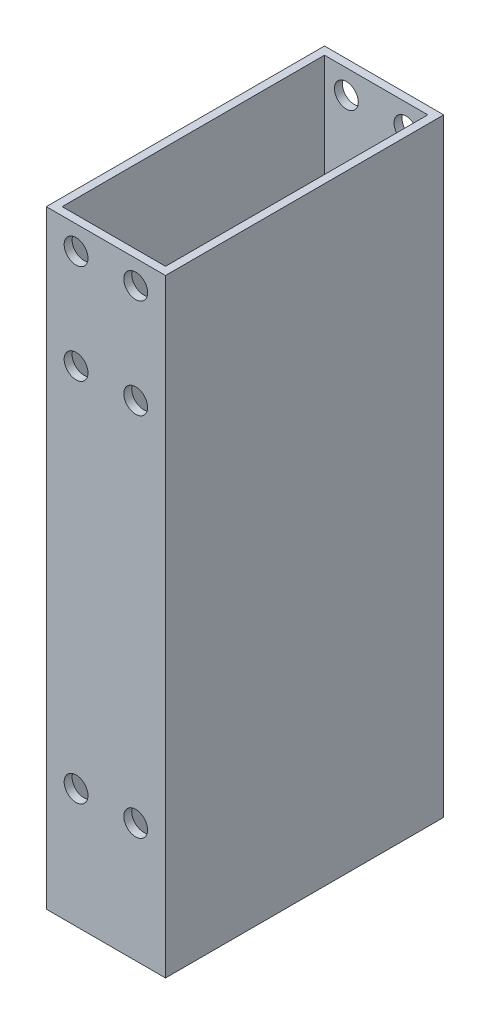
ISO-10303-21;
HEADER;
FILE_DESCRIPTION(('STEP AP214'),'2;1');
FILE_NAME('part.step','',(''),(''),'','','');
FILE_SCHEMA(('AUTOMOTIVE_DESIGN { 1 0 10303 214 1 1 1 1 }'));
ENDSEC;
DATA;
#1=APPLICATION_CONTEXT('core data for automotive mechanical design processes');
#2=APPLICATION_PROTOCOL_DEFINITION('international standard','automotive_design',2000,#1);
#3=PRODUCT_CONTEXT('',#1,'mechanical');
#4=PRODUCT('Part','Part','',(#3));
#5=PRODUCT_RELATED_PRODUCT_CATEGORY('part','',(#4));
#6=PRODUCT_DEFINITION_FORMATION('','',#4);
#7=PRODUCT_DEFINITION_CONTEXT('part definition',#1,'design');
#8=PRODUCT_DEFINITION('design','',#6,#7);
#9=PRODUCT_DEFINITION_SHAPE('','',#8);
#10=(LENGTH_UNIT() NAMED_UNIT(*) SI_UNIT(.MILLI.,.METRE.));
#11=(NAMED_UNIT(*) PLANE_ANGLE_UNIT() SI_UNIT($,.RADIAN.));
#12=(NAMED_UNIT(*) SI_UNIT($,.STERADIAN.) SOLID_ANGLE_UNIT());
#13=UNCERTAINTY_MEASURE_WITH_UNIT(LENGTH_MEASURE(1.E-05),#10,'distance_accuracy_value','');
#14=(GEOMETRIC_REPRESENTATION_CONTEXT(3) GLOBAL_UNCERTAINTY_ASSIGNED_CONTEXT((#13)) GLOBAL_UNIT_ASSIGNED_CONTEXT((#10,
#11,#12)) REPRESENTATION_CONTEXT('',''));
#15=CARTESIAN_POINT('',(0.,0.,0.));
#16=DIRECTION('',(0.,0.,1.));
#17=DIRECTION('',(1.,0.,0.));
#18=AXIS2_PLACEMENT_3D('',#15,#16,#17);
#19=CARTESIAN_POINT('',(0.,0.,70.));
#20=DIRECTION('',(0.,0.,1.));
#21=DIRECTION('',(1.,0.,0.));
#22=AXIS2_PLACEMENT_3D('',#19,#20,#21);
#23=PLANE('',#22);
#24=CARTESIAN_POINT('',(7.49999996451092,377.074776010889,70.));
#25=DIRECTION('',(0.,0.,1.));
#26=DIRECTION('',(1.,0.,0.));
#27=AXIS2_PLACEMENT_3D('',#24,#25,#26);
#28=CIRCLE('',#27,3.);
#29=CARTESIAN_POINT('',(10.4999999645109,377.074776010889,70.));
#30=VERTEX_POINT('',#29);
#31=EDGE_CURVE('E320',#30,#30,#28,.T.);
#32=ORIENTED_EDGE('',*,*,#31,.F.);
#33=EDGE_LOOP('',(#32));
#34=FACE_BOUND('',#33,.T.);
#35=CARTESIAN_POINT('',(7.49999996451087,352.074776010889,70.));
#36=DIRECTION('',(0.,0.,1.));
#37=DIRECTION('',(1.,0.,0.));
#38=AXIS2_PLACEMENT_3D('',#35,#36,#37);
#39=CIRCLE('',#38,3.);
#40=CARTESIAN_POINT('',(10.4999999645109,352.074776010889,70.));
#41=VERTEX_POINT('',#40);
#42=EDGE_CURVE('E328',#41,#41,#39,.T.);
#43=ORIENTED_EDGE('',*,*,#42,.F.);
#44=EDGE_LOOP('',(#43));
#45=FACE_BOUND('',#44,.T.);
#46=CARTESIAN_POINT('',(-7.50000003548913,352.074776010889,70.));
#47=DIRECTION('',(0.,0.,1.));
#48=DIRECTION('',(1.,0.,0.));
#49=AXIS2_PLACEMENT_3D('',#46,#47,#48);
#50=CIRCLE('',#49,3.);
#51=CARTESIAN_POINT('',(-4.50000003548913,352.074776010889,70.));
#52=VERTEX_POINT('',#51);
#53=EDGE_CURVE('E324',#52,#52,#50,.T.);
#54=ORIENTED_EDGE('',*,*,#53,.F.);
#55=EDGE_LOOP('',(#54));
#56=FACE_BOUND('',#55,.T.);
#57=CARTESIAN_POINT('',(-7.50012109716645,260.00000000794,70.));
#58=DIRECTION('',(0.,0.,1.));
#59=DIRECTION('',(1.,0.,0.));
#60=AXIS2_PLACEMENT_3D('',#57,#58,#59);
#61=CIRCLE('',#60,2.99999999999471);
#62=CARTESIAN_POINT('',(-4.50012109717174,260.00000000794,70.));
#63=VERTEX_POINT('',#62);
#64=EDGE_CURVE('E321',#63,#63,#61,.T.);
#65=ORIENTED_EDGE('',*,*,#64,.F.);
#66=EDGE_LOOP('',(#65));
#67=FACE_BOUND('',#66,.T.);
#68=CARTESIAN_POINT('',(7.49987890283355,260.00000000794,70.));
#69=DIRECTION('',(0.,0.,1.));
#70=DIRECTION('',(1.,0.,0.));
#71=AXIS2_PLACEMENT_3D('',#68,#69,#70);
#72=CIRCLE('',#71,2.99999999999471);
#73=CARTESIAN_POINT('',(10.4998789028283,260.00000000794,70.));
#74=VERTEX_POINT('',#73);
#75=EDGE_CURVE('E325',#74,#74,#72,.T.);
#76=ORIENTED_EDGE('',*,*,#75,.F.);
#77=EDGE_LOOP('',(#76));
#78=FACE_BOUND('',#77,.T.);
#79=CARTESIAN_POINT('',(-7.50000003548908,377.074776010889,70.));
#80=DIRECTION('',(0.,0.,1.));
#81=DIRECTION('',(1.,0.,0.));
#82=AXIS2_PLACEMENT_3D('',#79,#80,#81);
#83=CIRCLE('',#82,3.);
#84=CARTESIAN_POINT('',(-4.50000003548908,377.074776010889,70.));
#85=VERTEX_POINT('',#84);
#86=EDGE_CURVE('E144',#85,#85,#83,.T.);
#87=ORIENTED_EDGE('',*,*,#86,.F.);
#88=EDGE_LOOP('',(#87));
#89=FACE_BOUND('',#88,.T.);
#90=DIRECTION('',(-1.,0.,0.));
#91=VECTOR('',#90,1.);
#92=CARTESIAN_POINT('',(-15.,230.,70.));
#93=LINE('',#92,#91);
#94=CARTESIAN_POINT('',(15.,230.,70.));
#95=VERTEX_POINT('',#94);
#96=CARTESIAN_POINT('',(-15.,230.,70.));
#97=VERTEX_POINT('',#96);
#98=EDGE_CURVE('E106',#95,#97,#93,.T.);
#99=ORIENTED_EDGE('',*,*,#98,.F.);
#100=DIRECTION('',(0.,1.,0.));
#101=VECTOR('',#100,1.);
#102=CARTESIAN_POINT('',(15.,-383.07,70.));
#103=LINE('',#102,#101);
#104=CARTESIAN_POINT('',(15.,383.07,70.));
#105=VERTEX_POINT('',#104);
#106=EDGE_CURVE('E212',#95,#105,#103,.T.);
#107=ORIENTED_EDGE('',*,*,#106,.T.);
#108=DIRECTION('',(-1.,0.,0.));
#109=VECTOR('',#108,1.);
#110=CARTESIAN_POINT('',(15.,383.07,70.));
#111=LINE('',#110,#109);
#112=CARTESIAN_POINT('',(-15.,383.07,70.));
#113=VERTEX_POINT('',#112);
#114=EDGE_CURVE('E132',#105,#113,#111,.T.);
#115=ORIENTED_EDGE('',*,*,#114,.T.);
#116=DIRECTION('',(0.,-1.,0.));
#117=VECTOR('',#116,1.);
#118=CARTESIAN_POINT('',(-15.,-383.07,70.));
#119=LINE('',#118,#117);
#120=EDGE_CURVE('E136',#113,#97,#119,.T.);
#121=ORIENTED_EDGE('',*,*,#120,.T.);
#122=EDGE_LOOP('',(#99,#107,#115,#121));
#123=FACE_BOUND('',#122,.T.);
#124=ADVANCED_FACE('F39',(#34,#45,#56,#67,#78,#89,#123),#23,.T.);
#125=CARTESIAN_POINT('',(0.,0.,0.));
#126=DIRECTION('',(0.,0.,1.));
#127=DIRECTION('',(1.,0.,0.));
#128=AXIS2_PLACEMENT_3D('',#125,#126,#127);
#129=PLANE('',#128);
#130=CARTESIAN_POINT('',(7.49999996451092,377.074776010889,0.));
#131=DIRECTION('',(0.,0.,1.));
#132=DIRECTION('',(1.,0.,0.));
#133=AXIS2_PLACEMENT_3D('',#130,#131,#132);
#134=CIRCLE('',#133,3.);
#135=CARTESIAN_POINT('',(10.4999999645109,377.074776010889,0.));
#136=VERTEX_POINT('',#135);
#137=EDGE_CURVE('E181',#136,#136,#134,.T.);
#138=ORIENTED_EDGE('',*,*,#137,.T.);
#139=EDGE_LOOP('',(#138));
#140=FACE_BOUND('',#139,.T.);
#141=CARTESIAN_POINT('',(7.49999996451087,352.074776010889,0.));
#142=DIRECTION('',(0.,0.,1.));
#143=DIRECTION('',(1.,0.,0.));
#144=AXIS2_PLACEMENT_3D('',#141,#142,#143);
#145=CIRCLE('',#144,3.);
#146=CARTESIAN_POINT('',(10.4999999645109,352.074776010889,0.));
#147=VERTEX_POINT('',#146);
#148=EDGE_CURVE('E166',#147,#147,#145,.T.);
#149=ORIENTED_EDGE('',*,*,#148,.T.);
#150=EDGE_LOOP('',(#149));
#151=FACE_BOUND('',#150,.T.);
#152=CARTESIAN_POINT('',(-7.50000003548913,352.074776010889,0.));
#153=DIRECTION('',(0.,0.,1.));
#154=DIRECTION('',(1.,0.,0.));
#155=AXIS2_PLACEMENT_3D('',#152,#153,#154);
#156=CIRCLE('',#155,3.);
#157=CARTESIAN_POINT('',(-4.50000003548913,352.074776010889,0.));
#158=VERTEX_POINT('',#157);
#159=EDGE_CURVE('E162',#158,#158,#156,.T.);
#160=ORIENTED_EDGE('',*,*,#159,.T.);
#161=EDGE_LOOP('',(#160));
#162=FACE_BOUND('',#161,.T.);
#163=CARTESIAN_POINT('',(-7.50012109716645,260.00000000794,0.));
#164=DIRECTION('',(0.,0.,1.));
#165=DIRECTION('',(1.,0.,0.));
#166=AXIS2_PLACEMENT_3D('',#163,#164,#165);
#167=CIRCLE('',#166,2.99999999999471);
#168=CARTESIAN_POINT('',(-4.50012109717174,260.00000000794,0.));
#169=VERTEX_POINT('',#168);
#170=EDGE_CURVE('E158',#169,#169,#167,.T.);
#171=ORIENTED_EDGE('',*,*,#170,.T.);
#172=EDGE_LOOP('',(#171));
#173=FACE_BOUND('',#172,.T.);
#174=CARTESIAN_POINT('',(7.49987890283355,260.00000000794,0.));
#175=DIRECTION('',(0.,0.,1.));
#176=DIRECTION('',(1.,0.,0.));
#177=AXIS2_PLACEMENT_3D('',#174,#175,#176);
#178=CIRCLE('',#177,2.99999999999471);
#179=CARTESIAN_POINT('',(10.4998789028283,260.00000000794,0.));
#180=VERTEX_POINT('',#179);
#181=EDGE_CURVE('E154',#180,#180,#178,.T.);
#182=ORIENTED_EDGE('',*,*,#181,.T.);
#183=EDGE_LOOP('',(#182));
#184=FACE_BOUND('',#183,.T.);
#185=CARTESIAN_POINT('',(-7.50000003548908,377.074776010889,0.));
#186=DIRECTION('',(0.,0.,1.));
#187=DIRECTION('',(1.,0.,0.));
#188=AXIS2_PLACEMENT_3D('',#185,#186,#187);
#189=CIRCLE('',#188,3.);
#190=CARTESIAN_POINT('',(-4.50000003548908,377.074776010889,0.));
#191=VERTEX_POINT('',#190);
#192=EDGE_CURVE('E149',#191,#191,#189,.T.);
#193=ORIENTED_EDGE('',*,*,#192,.T.);
#194=EDGE_LOOP('',(#193));
#195=FACE_BOUND('',#194,.T.);
#196=DIRECTION('',(0.,1.,0.));
#197=VECTOR('',#196,1.);
#198=CARTESIAN_POINT('',(15.,-383.07,0.));
#199=LINE('',#198,#197);
#200=CARTESIAN_POINT('',(15.,230.,0.));
#201=VERTEX_POINT('',#200);
#202=CARTESIAN_POINT('',(15.,383.07,0.));
#203=VERTEX_POINT('',#202);
#204=EDGE_CURVE('E119',#201,#203,#199,.T.);
#205=ORIENTED_EDGE('',*,*,#204,.F.);
#206=DIRECTION('',(-1.,0.,0.));
#207=VECTOR('',#206,1.);
#208=CARTESIAN_POINT('',(-15.,230.,0.));
#209=LINE('',#208,#207);
#210=CARTESIAN_POINT('',(-15.,230.,0.));
#211=VERTEX_POINT('',#210);
#212=EDGE_CURVE('E56',#201,#211,#209,.T.);
#213=ORIENTED_EDGE('',*,*,#212,.T.);
#214=DIRECTION('',(0.,-1.,0.));
#215=VECTOR('',#214,1.);
#216=CARTESIAN_POINT('',(-15.,-383.07,0.));
#217=LINE('',#216,#215);
#218=CARTESIAN_POINT('',(-15.,383.07,0.));
#219=VERTEX_POINT('',#218);
#220=EDGE_CURVE('E118',#219,#211,#217,.T.);
#221=ORIENTED_EDGE('',*,*,#220,.F.);
#222=DIRECTION('',(-1.,0.,0.));
#223=VECTOR('',#222,1.);
#224=CARTESIAN_POINT('',(15.,383.07,0.));
#225=LINE('',#224,#223);
#226=EDGE_CURVE('E126',#203,#219,#225,.T.);
#227=ORIENTED_EDGE('',*,*,#226,.F.);
#228=EDGE_LOOP('',(#205,#213,#221,#227));
#229=FACE_BOUND('',#228,.T.);
#230=ADVANCED_FACE('F116',(#140,#151,#162,#173,#184,#195,#229),#129,.F.);
#231=CARTESIAN_POINT('',(-15.,-383.07,70.));
#232=DIRECTION('',(1.,0.,0.));
#233=DIRECTION('',(0.,0.,-1.));
#234=AXIS2_PLACEMENT_3D('',#231,#232,#233);
#235=PLANE('',#234);
#236=ORIENTED_EDGE('',*,*,#220,.T.);
#237=DIRECTION('',(0.,0.,1.));
#238=VECTOR('',#237,1.);
#239=CARTESIAN_POINT('',(-15.,230.,0.));
#240=LINE('',#239,#238);
#241=EDGE_CURVE('E103',#211,#97,#240,.T.);
#242=ORIENTED_EDGE('',*,*,#241,.T.);
#243=ORIENTED_EDGE('',*,*,#120,.F.);
#244=DIRECTION('',(0.,0.,-1.));
#245=VECTOR('',#244,1.);
#246=CARTESIAN_POINT('',(-15.,383.07,70.));
#247=LINE('',#246,#245);
#248=EDGE_CURVE('E123',#113,#219,#247,.T.);
#249=ORIENTED_EDGE('',*,*,#248,.T.);
#250=EDGE_LOOP('',(#236,#242,#243,#249));
#251=FACE_BOUND('',#250,.T.);
#252=ADVANCED_FACE('F41',(#251),#235,.F.);
#253=CARTESIAN_POINT('',(15.,-383.07,70.));
#254=DIRECTION('',(-1.,0.,0.));
#255=DIRECTION('',(0.,0.,1.));
#256=AXIS2_PLACEMENT_3D('',#253,#254,#255);
#257=PLANE('',#256);
#258=ORIENTED_EDGE('',*,*,#106,.F.);
#259=DIRECTION('',(0.,0.,1.));
#260=VECTOR('',#259,1.);
#261=CARTESIAN_POINT('',(15.,230.,0.));
#262=LINE('',#261,#260);
#263=EDGE_CURVE('E111',#201,#95,#262,.T.);
#264=ORIENTED_EDGE('',*,*,#263,.F.);
#265=ORIENTED_EDGE('',*,*,#204,.T.);
#266=DIRECTION('',(0.,0.,-1.));
#267=VECTOR('',#266,1.);
#268=CARTESIAN_POINT('',(15.,383.07,70.));
#269=LINE('',#268,#267);
#270=EDGE_CURVE('E48',#105,#203,#269,.T.);
#271=ORIENTED_EDGE('',*,*,#270,.F.);
#272=EDGE_LOOP('',(#258,#264,#265,#271));
#273=FACE_BOUND('',#272,.T.);
#274=ADVANCED_FACE('F220',(#273),#257,.F.);
#275=CARTESIAN_POINT('',(15.,383.07,70.));
#276=DIRECTION('',(0.,-1.,0.));
#277=DIRECTION('',(0.,0.,-1.));
#278=AXIS2_PLACEMENT_3D('',#275,#276,#277);
#279=PLANE('',#278);
#280=DIRECTION('',(0.,0.,-1.));
#281=VECTOR('',#280,1.);
#282=CARTESIAN_POINT('',(-13.,383.07,68.));
#283=LINE('',#282,#281);
#284=CARTESIAN_POINT('',(-13.,383.07,68.));
#285=VERTEX_POINT('',#284);
#286=CARTESIAN_POINT('',(-13.,383.07,2.));
#287=VERTEX_POINT('',#286);
#288=EDGE_CURVE('E201',#285,#287,#283,.T.);
#289=ORIENTED_EDGE('',*,*,#288,.T.);
#290=DIRECTION('',(1.,0.,0.));
#291=VECTOR('',#290,1.);
#292=CARTESIAN_POINT('',(-13.,383.07,2.));
#293=LINE('',#292,#291);
#294=CARTESIAN_POINT('',(13.,383.07,2.));
#295=VERTEX_POINT('',#294);
#296=EDGE_CURVE('E193',#287,#295,#293,.T.);
#297=ORIENTED_EDGE('',*,*,#296,.T.);
#298=DIRECTION('',(0.,0.,-1.));
#299=VECTOR('',#298,1.);
#300=CARTESIAN_POINT('',(13.,383.07,68.));
#301=LINE('',#300,#299);
#302=CARTESIAN_POINT('',(13.,383.07,68.));
#303=VERTEX_POINT('',#302);
#304=EDGE_CURVE('E196',#303,#295,#301,.T.);
#305=ORIENTED_EDGE('',*,*,#304,.F.);
#306=DIRECTION('',(1.,0.,0.));
#307=VECTOR('',#306,1.);
#308=CARTESIAN_POINT('',(-13.,383.07,68.));
#309=LINE('',#308,#307);
#310=EDGE_CURVE('E198',#285,#303,#309,.T.);
#311=ORIENTED_EDGE('',*,*,#310,.F.);
#312=EDGE_LOOP('',(#289,#297,#305,#311));
#313=FACE_BOUND('',#312,.T.);
#314=ORIENTED_EDGE('',*,*,#226,.T.);
#315=ORIENTED_EDGE('',*,*,#248,.F.);
#316=ORIENTED_EDGE('',*,*,#114,.F.);
#317=ORIENTED_EDGE('',*,*,#270,.T.);
#318=EDGE_LOOP('',(#314,#315,#316,#317));
#319=FACE_BOUND('',#318,.T.);
#320=ADVANCED_FACE('F218',(#313,#319),#279,.F.);
#321=CARTESIAN_POINT('',(-13.,383.07,2.));
#322=DIRECTION('',(0.,0.,-1.));
#323=DIRECTION('',(-1.,0.,0.));
#324=AXIS2_PLACEMENT_3D('',#321,#322,#323);
#325=PLANE('',#324);
#326=CARTESIAN_POINT('',(7.49999996451092,377.074776010889,2.));
#327=DIRECTION('',(0.,0.,-1.));
#328=DIRECTION('',(-1.,0.,0.));
#329=AXIS2_PLACEMENT_3D('',#326,#327,#328);
#330=CIRCLE('',#329,3.);
#331=CARTESIAN_POINT('',(4.49999996451092,377.074776010889,2.));
#332=VERTEX_POINT('',#331);
#333=EDGE_CURVE('E178',#332,#332,#330,.T.);
#334=ORIENTED_EDGE('',*,*,#333,.T.);
#335=EDGE_LOOP('',(#334));
#336=FACE_BOUND('',#335,.T.);
#337=CARTESIAN_POINT('',(7.49999996451087,352.074776010889,2.));
#338=DIRECTION('',(0.,0.,-1.));
#339=DIRECTION('',(-1.,0.,0.));
#340=AXIS2_PLACEMENT_3D('',#337,#338,#339);
#341=CIRCLE('',#340,3.);
#342=CARTESIAN_POINT('',(4.49999996451087,352.074776010889,2.));
#343=VERTEX_POINT('',#342);
#344=EDGE_CURVE('E161',#343,#343,#341,.T.);
#345=ORIENTED_EDGE('',*,*,#344,.T.);
#346=EDGE_LOOP('',(#345));
#347=FACE_BOUND('',#346,.T.);
#348=CARTESIAN_POINT('',(-7.50000003548913,352.074776010889,2.));
#349=DIRECTION('',(0.,0.,-1.));
#350=DIRECTION('',(-1.,0.,0.));
#351=AXIS2_PLACEMENT_3D('',#348,#349,#350);
#352=CIRCLE('',#351,3.);
#353=CARTESIAN_POINT('',(-10.5000000354891,352.074776010889,2.));
#354=VERTEX_POINT('',#353);
#355=EDGE_CURVE('E157',#354,#354,#352,.T.);
#356=ORIENTED_EDGE('',*,*,#355,.T.);
#357=EDGE_LOOP('',(#356));
#358=FACE_BOUND('',#357,.T.);
#359=CARTESIAN_POINT('',(-7.50012109716645,260.00000000794,2.));
#360=DIRECTION('',(0.,0.,-1.));
#361=DIRECTION('',(-1.,0.,0.));
#362=AXIS2_PLACEMENT_3D('',#359,#360,#361);
#363=CIRCLE('',#362,2.99999999999471);
#364=CARTESIAN_POINT('',(-10.5001210971612,260.00000000794,2.));
#365=VERTEX_POINT('',#364);
#366=EDGE_CURVE('E153',#365,#365,#363,.T.);
#367=ORIENTED_EDGE('',*,*,#366,.T.);
#368=EDGE_LOOP('',(#367));
#369=FACE_BOUND('',#368,.T.);
#370=CARTESIAN_POINT('',(7.49987890283355,260.00000000794,2.));
#371=DIRECTION('',(0.,0.,-1.));
#372=DIRECTION('',(-1.,0.,0.));
#373=AXIS2_PLACEMENT_3D('',#370,#371,#372);
#374=CIRCLE('',#373,2.99999999999471);
#375=CARTESIAN_POINT('',(4.49987890283884,260.00000000794,2.));
#376=VERTEX_POINT('',#375);
#377=EDGE_CURVE('E148',#376,#376,#374,.T.);
#378=ORIENTED_EDGE('',*,*,#377,.T.);
#379=EDGE_LOOP('',(#378));
#380=FACE_BOUND('',#379,.T.);
#381=CARTESIAN_POINT('',(-7.50000003548908,377.074776010889,2.));
#382=DIRECTION('',(0.,0.,-1.));
#383=DIRECTION('',(-1.,0.,0.));
#384=AXIS2_PLACEMENT_3D('',#381,#382,#383);
#385=CIRCLE('',#384,3.);
#386=CARTESIAN_POINT('',(-10.5000000354891,377.074776010889,2.));
#387=VERTEX_POINT('',#386);
#388=EDGE_CURVE('E143',#387,#387,#385,.T.);
#389=ORIENTED_EDGE('',*,*,#388,.T.);
#390=EDGE_LOOP('',(#389));
#391=FACE_BOUND('',#390,.T.);
#392=DIRECTION('',(0.,-1.,0.));
#393=VECTOR('',#392,1.);
#394=CARTESIAN_POINT('',(-13.,383.07,2.));
#395=LINE('',#394,#393);
#396=CARTESIAN_POINT('',(-13.,230.,2.));
#397=VERTEX_POINT('',#396);
#398=EDGE_CURVE('E124',#287,#397,#395,.T.);
#399=ORIENTED_EDGE('',*,*,#398,.T.);
#400=DIRECTION('',(1.,0.,0.));
#401=VECTOR('',#400,1.);
#402=CARTESIAN_POINT('',(-12.9999999999997,230.,2.));
#403=LINE('',#402,#401);
#404=CARTESIAN_POINT('',(13.,230.,2.));
#405=VERTEX_POINT('',#404);
#406=EDGE_CURVE('E190',#397,#405,#403,.T.);
#407=ORIENTED_EDGE('',*,*,#406,.T.);
#408=DIRECTION('',(0.,-1.,0.));
#409=VECTOR('',#408,1.);
#410=CARTESIAN_POINT('',(13.,383.07,2.));
#411=LINE('',#410,#409);
#412=EDGE_CURVE('E203',#295,#405,#411,.T.);
#413=ORIENTED_EDGE('',*,*,#412,.F.);
#414=ORIENTED_EDGE('',*,*,#296,.F.);
#415=EDGE_LOOP('',(#399,#407,#413,#414));
#416=FACE_BOUND('',#415,.T.);
#417=ADVANCED_FACE('F226',(#336,#347,#358,#369,#380,#391,#416),#325,.F.);
#418=CARTESIAN_POINT('',(-13.,383.07,68.));
#419=DIRECTION('',(-1.,0.,0.));
#420=DIRECTION('',(0.,0.,1.));
#421=AXIS2_PLACEMENT_3D('',#418,#419,#420);
#422=PLANE('',#421);
#423=DIRECTION('',(0.,-1.,0.));
#424=VECTOR('',#423,1.);
#425=CARTESIAN_POINT('',(-13.,383.07,68.));
#426=LINE('',#425,#424);
#427=CARTESIAN_POINT('',(-13.,230.,68.));
#428=VERTEX_POINT('',#427);
#429=EDGE_CURVE('E129',#285,#428,#426,.T.);
#430=ORIENTED_EDGE('',*,*,#429,.T.);
#431=DIRECTION('',(0.,0.,-1.));
#432=VECTOR('',#431,1.);
#433=CARTESIAN_POINT('',(-13.,230.,68.));
#434=LINE('',#433,#432);
#435=EDGE_CURVE('E187',#428,#397,#434,.T.);
#436=ORIENTED_EDGE('',*,*,#435,.T.);
#437=ORIENTED_EDGE('',*,*,#398,.F.);
#438=ORIENTED_EDGE('',*,*,#288,.F.);
#439=EDGE_LOOP('',(#430,#436,#437,#438));
#440=FACE_BOUND('',#439,.T.);
#441=ADVANCED_FACE('F242',(#440),#422,.F.);
#442=CARTESIAN_POINT('',(-13.,383.07,68.));
#443=DIRECTION('',(0.,0.,-1.));
#444=DIRECTION('',(-1.,0.,0.));
#445=AXIS2_PLACEMENT_3D('',#442,#443,#444);
#446=PLANE('',#445);
#447=CARTESIAN_POINT('',(7.49999996451092,377.074776010889,68.));
#448=DIRECTION('',(0.,0.,-1.));
#449=DIRECTION('',(-1.,0.,0.));
#450=AXIS2_PLACEMENT_3D('',#447,#448,#449);
#451=CIRCLE('',#450,3.);
#452=CARTESIAN_POINT('',(4.49999996451092,377.074776010889,68.));
#453=VERTEX_POINT('',#452);
#454=EDGE_CURVE('E43',#453,#453,#451,.T.);
#455=ORIENTED_EDGE('',*,*,#454,.F.);
#456=EDGE_LOOP('',(#455));
#457=FACE_BOUND('',#456,.T.);
#458=CARTESIAN_POINT('',(7.49999996451087,352.074776010889,68.));
#459=DIRECTION('',(0.,0.,-1.));
#460=DIRECTION('',(-1.,0.,0.));
#461=AXIS2_PLACEMENT_3D('',#458,#459,#460);
#462=CIRCLE('',#461,3.);
#463=CARTESIAN_POINT('',(4.49999996451087,352.074776010889,68.));
#464=VERTEX_POINT('',#463);
#465=EDGE_CURVE('E159',#464,#464,#462,.T.);
#466=ORIENTED_EDGE('',*,*,#465,.F.);
#467=EDGE_LOOP('',(#466));
#468=FACE_BOUND('',#467,.T.);
#469=CARTESIAN_POINT('',(-7.50000003548913,352.074776010889,68.));
#470=DIRECTION('',(0.,0.,-1.));
#471=DIRECTION('',(-1.,0.,0.));
#472=AXIS2_PLACEMENT_3D('',#469,#470,#471);
#473=CIRCLE('',#472,3.);
#474=CARTESIAN_POINT('',(-10.5000000354891,352.074776010889,68.));
#475=VERTEX_POINT('',#474);
#476=EDGE_CURVE('E155',#475,#475,#473,.T.);
#477=ORIENTED_EDGE('',*,*,#476,.F.);
#478=EDGE_LOOP('',(#477));
#479=FACE_BOUND('',#478,.T.);
#480=CARTESIAN_POINT('',(-7.50012109716645,260.00000000794,68.));
#481=DIRECTION('',(0.,0.,-1.));
#482=DIRECTION('',(-1.,0.,0.));
#483=AXIS2_PLACEMENT_3D('',#480,#481,#482);
#484=CIRCLE('',#483,2.99999999999471);
#485=CARTESIAN_POINT('',(-10.5001210971612,260.00000000794,68.));
#486=VERTEX_POINT('',#485);
#487=EDGE_CURVE('E150',#486,#486,#484,.T.);
#488=ORIENTED_EDGE('',*,*,#487,.F.);
#489=EDGE_LOOP('',(#488));
#490=FACE_BOUND('',#489,.T.);
#491=CARTESIAN_POINT('',(7.49987890283355,260.00000000794,68.));
#492=DIRECTION('',(0.,0.,-1.));
#493=DIRECTION('',(-1.,0.,0.));
#494=AXIS2_PLACEMENT_3D('',#491,#492,#493);
#495=CIRCLE('',#494,2.99999999999471);
#496=CARTESIAN_POINT('',(4.49987890283884,260.00000000794,68.));
#497=VERTEX_POINT('',#496);
#498=EDGE_CURVE('E145',#497,#497,#495,.T.);
#499=ORIENTED_EDGE('',*,*,#498,.F.);
#500=EDGE_LOOP('',(#499));
#501=FACE_BOUND('',#500,.T.);
#502=CARTESIAN_POINT('',(-7.50000003548908,377.074776010889,68.));
#503=DIRECTION('',(0.,0.,-1.));
#504=DIRECTION('',(-1.,0.,0.));
#505=AXIS2_PLACEMENT_3D('',#502,#503,#504);
#506=CIRCLE('',#505,3.);
#507=CARTESIAN_POINT('',(-10.5000000354891,377.074776010889,68.));
#508=VERTEX_POINT('',#507);
#509=EDGE_CURVE('E140',#508,#508,#506,.T.);
#510=ORIENTED_EDGE('',*,*,#509,.F.);
#511=EDGE_LOOP('',(#510));
#512=FACE_BOUND('',#511,.T.);
#513=DIRECTION('',(1.,0.,0.));
#514=VECTOR('',#513,1.);
#515=CARTESIAN_POINT('',(-12.9999999999997,230.,68.));
#516=LINE('',#515,#514);
#517=CARTESIAN_POINT('',(13.,230.,68.));
#518=VERTEX_POINT('',#517);
#519=EDGE_CURVE('E63',#428,#518,#516,.T.);
#520=ORIENTED_EDGE('',*,*,#519,.F.);
#521=ORIENTED_EDGE('',*,*,#429,.F.);
#522=ORIENTED_EDGE('',*,*,#310,.T.);
#523=DIRECTION('',(0.,-1.,0.));
#524=VECTOR('',#523,1.);
#525=CARTESIAN_POINT('',(13.,383.07,68.));
#526=LINE('',#525,#524);
#527=EDGE_CURVE('E207',#303,#518,#526,.T.);
#528=ORIENTED_EDGE('',*,*,#527,.T.);
#529=EDGE_LOOP('',(#520,#521,#522,#528));
#530=FACE_BOUND('',#529,.T.);
#531=ADVANCED_FACE('F247',(#457,#468,#479,#490,#501,#512,#530),#446,.T.);
#532=CARTESIAN_POINT('',(13.,383.07,68.));
#533=DIRECTION('',(-1.,0.,0.));
#534=DIRECTION('',(0.,0.,1.));
#535=AXIS2_PLACEMENT_3D('',#532,#533,#534);
#536=PLANE('',#535);
#537=DIRECTION('',(0.,0.,-1.));
#538=VECTOR('',#537,1.);
#539=CARTESIAN_POINT('',(13.,230.,68.));
#540=LINE('',#539,#538);
#541=EDGE_CURVE('E11',#518,#405,#540,.T.);
#542=ORIENTED_EDGE('',*,*,#541,.F.);
#543=ORIENTED_EDGE('',*,*,#527,.F.);
#544=ORIENTED_EDGE('',*,*,#304,.T.);
#545=ORIENTED_EDGE('',*,*,#412,.T.);
#546=EDGE_LOOP('',(#542,#543,#544,#545));
#547=FACE_BOUND('',#546,.T.);
#548=ADVANCED_FACE('F244',(#547),#536,.T.);
#549=CARTESIAN_POINT('',(-15.,230.,0.));
#550=DIRECTION('',(0.,1.,0.));
#551=DIRECTION('',(-1.,0.,0.));
#552=AXIS2_PLACEMENT_3D('',#549,#550,#551);
#553=PLANE('',#552);
#554=ORIENTED_EDGE('',*,*,#98,.T.);
#555=ORIENTED_EDGE('',*,*,#241,.F.);
#556=ORIENTED_EDGE('',*,*,#212,.F.);
#557=ORIENTED_EDGE('',*,*,#263,.T.);
#558=EDGE_LOOP('',(#554,#555,#556,#557));
#559=FACE_BOUND('',#558,.T.);
#560=ORIENTED_EDGE('',*,*,#435,.F.);
#561=ORIENTED_EDGE('',*,*,#519,.T.);
#562=ORIENTED_EDGE('',*,*,#541,.T.);
#563=ORIENTED_EDGE('',*,*,#406,.F.);
#564=EDGE_LOOP('',(#560,#561,#562,#563));
#565=FACE_BOUND('',#564,.T.);
#566=ADVANCED_FACE('F104',(#559,#565),#553,.F.);
#567=CARTESIAN_POINT('',(-7.50000003548908,377.074776010889,-45.));
#568=DIRECTION('',(0.,0.,1.));
#569=DIRECTION('',(1.,0.,0.));
#570=AXIS2_PLACEMENT_3D('',#567,#568,#569);
#571=CYLINDRICAL_SURFACE('',#570,3.);
#572=ORIENTED_EDGE('',*,*,#509,.T.);
#573=EDGE_LOOP('',(#572));
#574=FACE_BOUND('',#573,.T.);
#575=ORIENTED_EDGE('',*,*,#86,.T.);
#576=EDGE_LOOP('',(#575));
#577=FACE_BOUND('',#576,.T.);
#578=ADVANCED_FACE('F257',(#574,#577),#571,.F.);
#579=CARTESIAN_POINT('',(7.49987890283355,260.00000000794,-45.));
#580=DIRECTION('',(0.,0.,1.));
#581=DIRECTION('',(1.,0.,0.));
#582=AXIS2_PLACEMENT_3D('',#579,#580,#581);
#583=CYLINDRICAL_SURFACE('',#582,2.99999999999471);
#584=ORIENTED_EDGE('',*,*,#498,.T.);
#585=EDGE_LOOP('',(#584));
#586=FACE_BOUND('',#585,.T.);
#587=ORIENTED_EDGE('',*,*,#75,.T.);
#588=EDGE_LOOP('',(#587));
#589=FACE_BOUND('',#588,.T.);
#590=ADVANCED_FACE('F260',(#586,#589),#583,.F.);
#591=CARTESIAN_POINT('',(-7.50012109716645,260.00000000794,-45.));
#592=DIRECTION('',(0.,0.,1.));
#593=DIRECTION('',(1.,0.,0.));
#594=AXIS2_PLACEMENT_3D('',#591,#592,#593);
#595=CYLINDRICAL_SURFACE('',#594,2.99999999999471);
#596=ORIENTED_EDGE('',*,*,#487,.T.);
#597=EDGE_LOOP('',(#596));
#598=FACE_BOUND('',#597,.T.);
#599=ORIENTED_EDGE('',*,*,#64,.T.);
#600=EDGE_LOOP('',(#599));
#601=FACE_BOUND('',#600,.T.);
#602=ADVANCED_FACE('F263',(#598,#601),#595,.F.);
#603=CARTESIAN_POINT('',(-7.50000003548913,352.074776010889,-45.));
#604=DIRECTION('',(0.,0.,1.));
#605=DIRECTION('',(1.,0.,0.));
#606=AXIS2_PLACEMENT_3D('',#603,#604,#605);
#607=CYLINDRICAL_SURFACE('',#606,3.);
#608=ORIENTED_EDGE('',*,*,#476,.T.);
#609=EDGE_LOOP('',(#608));
#610=FACE_BOUND('',#609,.T.);
#611=ORIENTED_EDGE('',*,*,#53,.T.);
#612=EDGE_LOOP('',(#611));
#613=FACE_BOUND('',#612,.T.);
#614=ADVANCED_FACE('F266',(#610,#613),#607,.F.);
#615=CARTESIAN_POINT('',(7.49999996451087,352.074776010889,-45.));
#616=DIRECTION('',(0.,0.,1.));
#617=DIRECTION('',(1.,0.,0.));
#618=AXIS2_PLACEMENT_3D('',#615,#616,#617);
#619=CYLINDRICAL_SURFACE('',#618,3.);
#620=ORIENTED_EDGE('',*,*,#465,.T.);
#621=EDGE_LOOP('',(#620));
#622=FACE_BOUND('',#621,.T.);
#623=ORIENTED_EDGE('',*,*,#42,.T.);
#624=EDGE_LOOP('',(#623));
#625=FACE_BOUND('',#624,.T.);
#626=ADVANCED_FACE('F271',(#622,#625),#619,.F.);
#627=CARTESIAN_POINT('',(7.49999996451092,377.074776010889,-45.));
#628=DIRECTION('',(0.,0.,1.));
#629=DIRECTION('',(1.,0.,0.));
#630=AXIS2_PLACEMENT_3D('',#627,#628,#629);
#631=CYLINDRICAL_SURFACE('',#630,3.);
#632=ORIENTED_EDGE('',*,*,#454,.T.);
#633=EDGE_LOOP('',(#632));
#634=FACE_BOUND('',#633,.T.);
#635=ORIENTED_EDGE('',*,*,#31,.T.);
#636=EDGE_LOOP('',(#635));
#637=FACE_BOUND('',#636,.T.);
#638=ADVANCED_FACE('F276',(#634,#637),#631,.F.);
#639=ORIENTED_EDGE('',*,*,#388,.F.);
#640=EDGE_LOOP('',(#639));
#641=FACE_BOUND('',#640,.T.);
#642=ORIENTED_EDGE('',*,*,#192,.F.);
#643=EDGE_LOOP('',(#642));
#644=FACE_BOUND('',#643,.T.);
#645=ADVANCED_FACE('F262',(#641,#644),#571,.F.);
#646=ORIENTED_EDGE('',*,*,#377,.F.);
#647=EDGE_LOOP('',(#646));
#648=FACE_BOUND('',#647,.T.);
#649=ORIENTED_EDGE('',*,*,#181,.F.);
#650=EDGE_LOOP('',(#649));
#651=FACE_BOUND('',#650,.T.);
#652=ADVANCED_FACE('F284',(#648,#651),#583,.F.);
#653=ORIENTED_EDGE('',*,*,#366,.F.);
#654=EDGE_LOOP('',(#653));
#655=FACE_BOUND('',#654,.T.);
#656=ORIENTED_EDGE('',*,*,#170,.F.);
#657=EDGE_LOOP('',(#656));
#658=FACE_BOUND('',#657,.T.);
#659=ADVANCED_FACE('F268',(#655,#658),#595,.F.);
#660=ORIENTED_EDGE('',*,*,#355,.F.);
#661=EDGE_LOOP('',(#660));
#662=FACE_BOUND('',#661,.T.);
#663=ORIENTED_EDGE('',*,*,#159,.F.);
#664=EDGE_LOOP('',(#663));
#665=FACE_BOUND('',#664,.T.);
#666=ADVANCED_FACE('F273',(#662,#665),#607,.F.);
#667=ORIENTED_EDGE('',*,*,#344,.F.);
#668=EDGE_LOOP('',(#667));
#669=FACE_BOUND('',#668,.T.);
#670=ORIENTED_EDGE('',*,*,#148,.F.);
#671=EDGE_LOOP('',(#670));
#672=FACE_BOUND('',#671,.T.);
#673=ADVANCED_FACE('F277',(#669,#672),#619,.F.);
#674=ORIENTED_EDGE('',*,*,#333,.F.);
#675=EDGE_LOOP('',(#674));
#676=FACE_BOUND('',#675,.T.);
#677=ORIENTED_EDGE('',*,*,#137,.F.);
#678=EDGE_LOOP('',(#677));
#679=FACE_BOUND('',#678,.T.);
#680=ADVANCED_FACE('F281',(#676,#679),#631,.F.);
#681=CLOSED_SHELL('',(#124,#230,#252,#274,#320,#417,#441,#531,#548,#566,#578,#590,#602,#614,
#626,#638,#645,#652,#659,#666,#673,#680));
#682=MANIFOLD_SOLID_BREP('B2',#681);
#683=ADVANCED_BREP_SHAPE_REPRESENTATION('',(#18,#682),#14);
#684=SHAPE_DEFINITION_REPRESENTATION(#9,#683);
ENDSEC;
END-ISO-10303-21;
